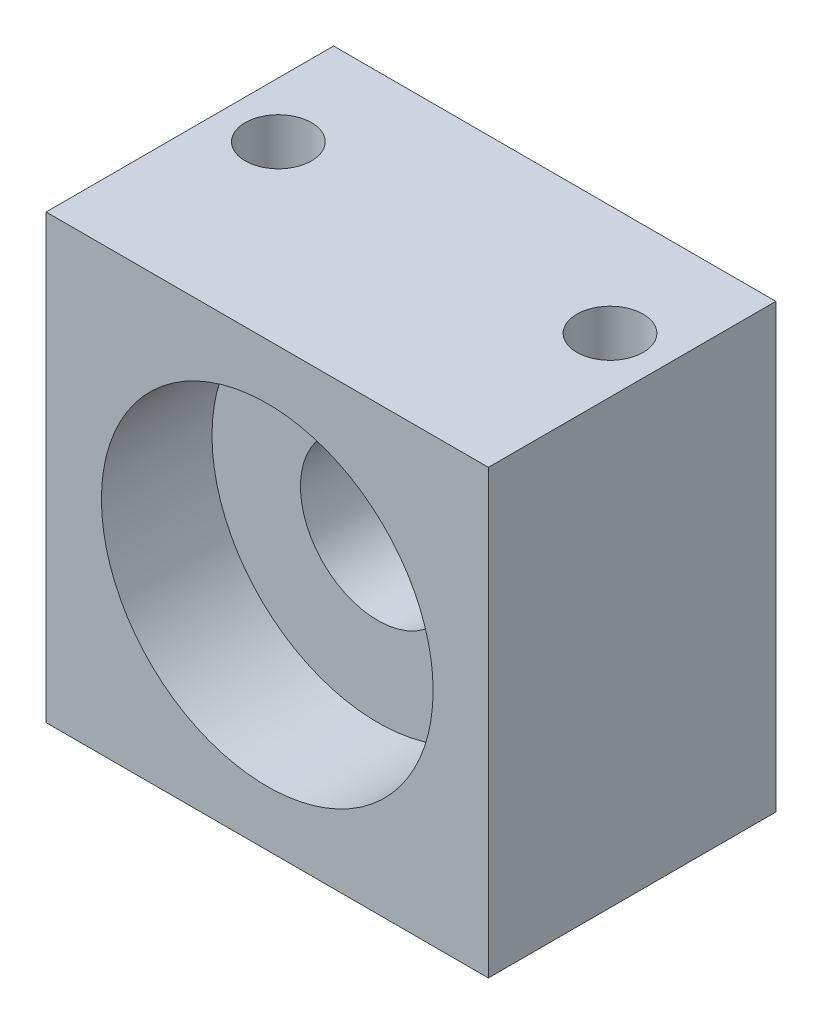
ISO-10303-21;
HEADER;
FILE_DESCRIPTION(('STEP AP214'),'2;1');
FILE_NAME('part.step','',(''),(''),'','','');
FILE_SCHEMA(('AUTOMOTIVE_DESIGN { 1 0 10303 214 1 1 1 1 }'));
ENDSEC;
DATA;
#1=APPLICATION_CONTEXT('core data for automotive mechanical design processes');
#2=APPLICATION_PROTOCOL_DEFINITION('international standard','automotive_design',2000,#1);
#3=PRODUCT_CONTEXT('',#1,'mechanical');
#4=PRODUCT('Part','Part','',(#3));
#5=PRODUCT_RELATED_PRODUCT_CATEGORY('part','',(#4));
#6=PRODUCT_DEFINITION_FORMATION('','',#4);
#7=PRODUCT_DEFINITION_CONTEXT('part definition',#1,'design');
#8=PRODUCT_DEFINITION('design','',#6,#7);
#9=PRODUCT_DEFINITION_SHAPE('','',#8);
#10=(LENGTH_UNIT() NAMED_UNIT(*) SI_UNIT(.MILLI.,.METRE.));
#11=(NAMED_UNIT(*) PLANE_ANGLE_UNIT() SI_UNIT($,.RADIAN.));
#12=(NAMED_UNIT(*) SI_UNIT($,.STERADIAN.) SOLID_ANGLE_UNIT());
#13=UNCERTAINTY_MEASURE_WITH_UNIT(LENGTH_MEASURE(1.E-05),#10,'distance_accuracy_value','');
#14=(GEOMETRIC_REPRESENTATION_CONTEXT(3) GLOBAL_UNCERTAINTY_ASSIGNED_CONTEXT((#13)) GLOBAL_UNIT_ASSIGNED_CONTEXT((#10,
#11,#12)) REPRESENTATION_CONTEXT('',''));
#15=CARTESIAN_POINT('',(0.,0.,0.));
#16=DIRECTION('',(0.,0.,1.));
#17=DIRECTION('',(1.,0.,0.));
#18=AXIS2_PLACEMENT_3D('',#15,#16,#17);
#19=CARTESIAN_POINT('',(0.,0.,13.));
#20=DIRECTION('',(1.,0.,0.));
#21=DIRECTION('',(0.,0.,-1.));
#22=AXIS2_PLACEMENT_3D('',#19,#20,#21);
#23=PLANE('',#22);
#24=DIRECTION('',(0.,-1.,0.));
#25=VECTOR('',#24,1.);
#26=CARTESIAN_POINT('',(0.,0.,0.));
#27=LINE('',#26,#25);
#28=CARTESIAN_POINT('',(0.,20.,0.));
#29=VERTEX_POINT('',#28);
#30=CARTESIAN_POINT('',(0.,0.,0.));
#31=VERTEX_POINT('',#30);
#32=EDGE_CURVE('E96',#29,#31,#27,.T.);
#33=ORIENTED_EDGE('',*,*,#32,.T.);
#34=DIRECTION('',(0.,0.,-1.));
#35=VECTOR('',#34,1.);
#36=CARTESIAN_POINT('',(0.,0.,13.));
#37=LINE('',#36,#35);
#38=CARTESIAN_POINT('',(0.,0.,13.));
#39=VERTEX_POINT('',#38);
#40=EDGE_CURVE('E11',#39,#31,#37,.T.);
#41=ORIENTED_EDGE('',*,*,#40,.F.);
#42=DIRECTION('',(0.,-1.,0.));
#43=VECTOR('',#42,1.);
#44=CARTESIAN_POINT('',(0.,0.,13.));
#45=LINE('',#44,#43);
#46=CARTESIAN_POINT('',(0.,20.,13.));
#47=VERTEX_POINT('',#46);
#48=EDGE_CURVE('E84',#47,#39,#45,.T.);
#49=ORIENTED_EDGE('',*,*,#48,.F.);
#50=DIRECTION('',(0.,0.,-1.));
#51=VECTOR('',#50,1.);
#52=CARTESIAN_POINT('',(0.,20.,13.));
#53=LINE('',#52,#51);
#54=EDGE_CURVE('E92',#47,#29,#53,.T.);
#55=ORIENTED_EDGE('',*,*,#54,.T.);
#56=EDGE_LOOP('',(#33,#41,#49,#55));
#57=FACE_BOUND('',#56,.T.);
#58=ADVANCED_FACE('F33',(#57),#23,.F.);
#59=CARTESIAN_POINT('',(0.,0.,13.));
#60=DIRECTION('',(0.,1.,0.));
#61=DIRECTION('',(0.,0.,1.));
#62=AXIS2_PLACEMENT_3D('',#59,#60,#61);
#63=PLANE('',#62);
#64=CARTESIAN_POINT('',(2.5,0.,5.));
#65=DIRECTION('',(0.,1.,0.));
#66=DIRECTION('',(0.,0.,1.));
#67=AXIS2_PLACEMENT_3D('',#64,#65,#66);
#68=CIRCLE('',#67,1.5);
#69=CARTESIAN_POINT('',(2.5,0.,6.5));
#70=VERTEX_POINT('',#69);
#71=EDGE_CURVE('E128',#70,#70,#68,.T.);
#72=ORIENTED_EDGE('',*,*,#71,.T.);
#73=EDGE_LOOP('',(#72));
#74=FACE_BOUND('',#73,.T.);
#75=CARTESIAN_POINT('',(17.5,0.,5.));
#76=DIRECTION('',(0.,1.,0.));
#77=DIRECTION('',(0.,0.,1.));
#78=AXIS2_PLACEMENT_3D('',#75,#76,#77);
#79=CIRCLE('',#78,1.5);
#80=CARTESIAN_POINT('',(17.5,0.,6.5));
#81=VERTEX_POINT('',#80);
#82=EDGE_CURVE('E119',#81,#81,#79,.T.);
#83=ORIENTED_EDGE('',*,*,#82,.T.);
#84=EDGE_LOOP('',(#83));
#85=FACE_BOUND('',#84,.T.);
#86=DIRECTION('',(1.,0.,0.));
#87=VECTOR('',#86,1.);
#88=CARTESIAN_POINT('',(0.,0.,0.));
#89=LINE('',#88,#87);
#90=CARTESIAN_POINT('',(20.,0.,0.));
#91=VERTEX_POINT('',#90);
#92=EDGE_CURVE('E88',#31,#91,#89,.T.);
#93=ORIENTED_EDGE('',*,*,#92,.T.);
#94=DIRECTION('',(0.,0.,-1.));
#95=VECTOR('',#94,1.);
#96=CARTESIAN_POINT('',(20.,0.,13.));
#97=LINE('',#96,#95);
#98=CARTESIAN_POINT('',(20.,0.,13.));
#99=VERTEX_POINT('',#98);
#100=EDGE_CURVE('E41',#99,#91,#97,.T.);
#101=ORIENTED_EDGE('',*,*,#100,.F.);
#102=DIRECTION('',(1.,0.,0.));
#103=VECTOR('',#102,1.);
#104=CARTESIAN_POINT('',(0.,0.,13.));
#105=LINE('',#104,#103);
#106=EDGE_CURVE('E79',#39,#99,#105,.T.);
#107=ORIENTED_EDGE('',*,*,#106,.F.);
#108=ORIENTED_EDGE('',*,*,#40,.T.);
#109=EDGE_LOOP('',(#93,#101,#107,#108));
#110=FACE_BOUND('',#109,.T.);
#111=ADVANCED_FACE('F87',(#74,#85,#110),#63,.F.);
#112=CARTESIAN_POINT('',(20.,0.,13.));
#113=DIRECTION('',(-1.,0.,0.));
#114=DIRECTION('',(0.,0.,1.));
#115=AXIS2_PLACEMENT_3D('',#112,#113,#114);
#116=PLANE('',#115);
#117=DIRECTION('',(0.,1.,0.));
#118=VECTOR('',#117,1.);
#119=CARTESIAN_POINT('',(20.,0.,0.));
#120=LINE('',#119,#118);
#121=CARTESIAN_POINT('',(20.,20.,0.));
#122=VERTEX_POINT('',#121);
#123=EDGE_CURVE('E66',#91,#122,#120,.T.);
#124=ORIENTED_EDGE('',*,*,#123,.T.);
#125=DIRECTION('',(0.,0.,-1.));
#126=VECTOR('',#125,1.);
#127=CARTESIAN_POINT('',(20.,20.,13.));
#128=LINE('',#127,#126);
#129=CARTESIAN_POINT('',(20.,20.,13.));
#130=VERTEX_POINT('',#129);
#131=EDGE_CURVE('E89',#130,#122,#128,.T.);
#132=ORIENTED_EDGE('',*,*,#131,.F.);
#133=DIRECTION('',(0.,1.,0.));
#134=VECTOR('',#133,1.);
#135=CARTESIAN_POINT('',(20.,0.,13.));
#136=LINE('',#135,#134);
#137=EDGE_CURVE('E82',#99,#130,#136,.T.);
#138=ORIENTED_EDGE('',*,*,#137,.F.);
#139=ORIENTED_EDGE('',*,*,#100,.T.);
#140=EDGE_LOOP('',(#124,#132,#138,#139));
#141=FACE_BOUND('',#140,.T.);
#142=ADVANCED_FACE('F90',(#141),#116,.F.);
#143=CARTESIAN_POINT('',(0.,20.,13.));
#144=DIRECTION('',(0.,-1.,0.));
#145=DIRECTION('',(0.,0.,-1.));
#146=AXIS2_PLACEMENT_3D('',#143,#144,#145);
#147=PLANE('',#146);
#148=CARTESIAN_POINT('',(2.5,20.,5.));
#149=DIRECTION('',(0.,1.,0.));
#150=DIRECTION('',(0.,0.,1.));
#151=AXIS2_PLACEMENT_3D('',#148,#149,#150);
#152=CIRCLE('',#151,1.5);
#153=CARTESIAN_POINT('',(2.5,20.,6.5));
#154=VERTEX_POINT('',#153);
#155=EDGE_CURVE('E125',#154,#154,#152,.T.);
#156=ORIENTED_EDGE('',*,*,#155,.F.);
#157=EDGE_LOOP('',(#156));
#158=FACE_BOUND('',#157,.T.);
#159=CARTESIAN_POINT('',(17.5,20.,5.));
#160=DIRECTION('',(0.,1.,0.));
#161=DIRECTION('',(0.,0.,1.));
#162=AXIS2_PLACEMENT_3D('',#159,#160,#161);
#163=CIRCLE('',#162,1.5);
#164=CARTESIAN_POINT('',(17.5,20.,6.5));
#165=VERTEX_POINT('',#164);
#166=EDGE_CURVE('E122',#165,#165,#163,.T.);
#167=ORIENTED_EDGE('',*,*,#166,.F.);
#168=EDGE_LOOP('',(#167));
#169=FACE_BOUND('',#168,.T.);
#170=DIRECTION('',(-1.,0.,0.));
#171=VECTOR('',#170,1.);
#172=CARTESIAN_POINT('',(0.,20.,0.));
#173=LINE('',#172,#171);
#174=EDGE_CURVE('E72',#122,#29,#173,.T.);
#175=ORIENTED_EDGE('',*,*,#174,.T.);
#176=ORIENTED_EDGE('',*,*,#54,.F.);
#177=DIRECTION('',(-1.,0.,0.));
#178=VECTOR('',#177,1.);
#179=CARTESIAN_POINT('',(0.,20.,13.));
#180=LINE('',#179,#178);
#181=EDGE_CURVE('E49',#130,#47,#180,.T.);
#182=ORIENTED_EDGE('',*,*,#181,.F.);
#183=ORIENTED_EDGE('',*,*,#131,.T.);
#184=EDGE_LOOP('',(#175,#176,#182,#183));
#185=FACE_BOUND('',#184,.T.);
#186=ADVANCED_FACE('F104',(#158,#169,#185),#147,.F.);
#187=CARTESIAN_POINT('',(0.,0.,13.));
#188=DIRECTION('',(0.,0.,-1.));
#189=DIRECTION('',(-1.,0.,0.));
#190=AXIS2_PLACEMENT_3D('',#187,#188,#189);
#191=PLANE('',#190);
#192=CARTESIAN_POINT('',(10.,10.,13.));
#193=DIRECTION('',(0.,0.,1.));
#194=DIRECTION('',(1.,0.,0.));
#195=AXIS2_PLACEMENT_3D('',#192,#193,#194);
#196=CIRCLE('',#195,7.5);
#197=CARTESIAN_POINT('',(17.5,10.,13.));
#198=VERTEX_POINT('',#197);
#199=EDGE_CURVE('E110',#198,#198,#196,.T.);
#200=ORIENTED_EDGE('',*,*,#199,.F.);
#201=EDGE_LOOP('',(#200));
#202=FACE_BOUND('',#201,.T.);
#203=ORIENTED_EDGE('',*,*,#48,.T.);
#204=ORIENTED_EDGE('',*,*,#106,.T.);
#205=ORIENTED_EDGE('',*,*,#137,.T.);
#206=ORIENTED_EDGE('',*,*,#181,.T.);
#207=EDGE_LOOP('',(#203,#204,#205,#206));
#208=FACE_BOUND('',#207,.T.);
#209=ADVANCED_FACE('F80',(#202,#208),#191,.F.);
#210=CARTESIAN_POINT('',(0.,0.,0.));
#211=DIRECTION('',(0.,0.,-1.));
#212=DIRECTION('',(-1.,0.,0.));
#213=AXIS2_PLACEMENT_3D('',#210,#211,#212);
#214=PLANE('',#213);
#215=ORIENTED_EDGE('',*,*,#32,.F.);
#216=ORIENTED_EDGE('',*,*,#174,.F.);
#217=ORIENTED_EDGE('',*,*,#123,.F.);
#218=ORIENTED_EDGE('',*,*,#92,.F.);
#219=EDGE_LOOP('',(#215,#216,#217,#218));
#220=FACE_BOUND('',#219,.T.);
#221=ADVANCED_FACE('F107',(#220),#214,.T.);
#222=CARTESIAN_POINT('',(10.,10.,8.));
#223=DIRECTION('',(0.,0.,1.));
#224=DIRECTION('',(1.,0.,0.));
#225=AXIS2_PLACEMENT_3D('',#222,#223,#224);
#226=CYLINDRICAL_SURFACE('',#225,7.5);
#227=CARTESIAN_POINT('',(10.,10.,8.));
#228=DIRECTION('',(0.,0.,1.));
#229=DIRECTION('',(1.,0.,0.));
#230=AXIS2_PLACEMENT_3D('',#227,#228,#229);
#231=CIRCLE('',#230,7.5);
#232=CARTESIAN_POINT('',(17.5,10.,8.));
#233=VERTEX_POINT('',#232);
#234=EDGE_CURVE('E99',#233,#233,#231,.T.);
#235=ORIENTED_EDGE('',*,*,#234,.F.);
#236=EDGE_LOOP('',(#235));
#237=FACE_BOUND('',#236,.T.);
#238=ORIENTED_EDGE('',*,*,#199,.T.);
#239=EDGE_LOOP('',(#238));
#240=FACE_BOUND('',#239,.T.);
#241=ADVANCED_FACE('F169',(#237,#240),#226,.F.);
#242=CARTESIAN_POINT('',(10.,10.,8.));
#243=DIRECTION('',(0.,0.,1.));
#244=DIRECTION('',(1.,0.,0.));
#245=AXIS2_PLACEMENT_3D('',#242,#243,#244);
#246=PLANE('',#245);
#247=CARTESIAN_POINT('',(10.,10.,8.));
#248=DIRECTION('',(0.,0.,1.));
#249=DIRECTION('',(1.,0.,0.));
#250=AXIS2_PLACEMENT_3D('',#247,#248,#249);
#251=CIRCLE('',#250,3.5);
#252=CARTESIAN_POINT('',(13.5,10.,8.));
#253=VERTEX_POINT('',#252);
#254=EDGE_CURVE('E116',#253,#253,#251,.T.);
#255=ORIENTED_EDGE('',*,*,#254,.F.);
#256=EDGE_LOOP('',(#255));
#257=FACE_BOUND('',#256,.T.);
#258=ORIENTED_EDGE('',*,*,#234,.T.);
#259=EDGE_LOOP('',(#258));
#260=FACE_BOUND('',#259,.T.);
#261=ADVANCED_FACE('F175',(#257,#260),#246,.T.);
#262=CARTESIAN_POINT('',(10.,10.,3.));
#263=DIRECTION('',(0.,0.,1.));
#264=DIRECTION('',(1.,0.,0.));
#265=AXIS2_PLACEMENT_3D('',#262,#263,#264);
#266=CYLINDRICAL_SURFACE('',#265,3.5);
#267=CARTESIAN_POINT('',(10.,10.,3.));
#268=DIRECTION('',(0.,0.,1.));
#269=DIRECTION('',(1.,0.,0.));
#270=AXIS2_PLACEMENT_3D('',#267,#268,#269);
#271=CIRCLE('',#270,3.5);
#272=CARTESIAN_POINT('',(13.5,10.,3.));
#273=VERTEX_POINT('',#272);
#274=EDGE_CURVE('E113',#273,#273,#271,.T.);
#275=ORIENTED_EDGE('',*,*,#274,.F.);
#276=EDGE_LOOP('',(#275));
#277=FACE_BOUND('',#276,.T.);
#278=ORIENTED_EDGE('',*,*,#254,.T.);
#279=EDGE_LOOP('',(#278));
#280=FACE_BOUND('',#279,.T.);
#281=ADVANCED_FACE('F152',(#277,#280),#266,.F.);
#282=CARTESIAN_POINT('',(10.,10.,3.));
#283=DIRECTION('',(0.,0.,1.));
#284=DIRECTION('',(1.,0.,0.));
#285=AXIS2_PLACEMENT_3D('',#282,#283,#284);
#286=PLANE('',#285);
#287=ORIENTED_EDGE('',*,*,#274,.T.);
#288=EDGE_LOOP('',(#287));
#289=FACE_BOUND('',#288,.T.);
#290=ADVANCED_FACE('F143',(#289),#286,.T.);
#291=CARTESIAN_POINT('',(17.5,0.,5.));
#292=DIRECTION('',(0.,1.,0.));
#293=DIRECTION('',(0.,0.,1.));
#294=AXIS2_PLACEMENT_3D('',#291,#292,#293);
#295=CYLINDRICAL_SURFACE('',#294,1.5);
#296=ORIENTED_EDGE('',*,*,#82,.F.);
#297=EDGE_LOOP('',(#296));
#298=FACE_BOUND('',#297,.T.);
#299=ORIENTED_EDGE('',*,*,#166,.T.);
#300=EDGE_LOOP('',(#299));
#301=FACE_BOUND('',#300,.T.);
#302=ADVANCED_FACE('F141',(#298,#301),#295,.F.);
#303=CARTESIAN_POINT('',(2.5,0.,5.));
#304=DIRECTION('',(0.,1.,0.));
#305=DIRECTION('',(0.,0.,1.));
#306=AXIS2_PLACEMENT_3D('',#303,#304,#305);
#307=CYLINDRICAL_SURFACE('',#306,1.5);
#308=ORIENTED_EDGE('',*,*,#71,.F.);
#309=EDGE_LOOP('',(#308));
#310=FACE_BOUND('',#309,.T.);
#311=ORIENTED_EDGE('',*,*,#155,.T.);
#312=EDGE_LOOP('',(#311));
#313=FACE_BOUND('',#312,.T.);
#314=ADVANCED_FACE('F134',(#310,#313),#307,.F.);
#315=CLOSED_SHELL('',(#58,#111,#142,#186,#209,#221,#241,#261,#281,#290,#302,#314));
#316=MANIFOLD_SOLID_BREP('B2',#315);
#317=ADVANCED_BREP_SHAPE_REPRESENTATION('',(#18,#316),#14);
#318=SHAPE_DEFINITION_REPRESENTATION(#9,#317);
ENDSEC;
END-ISO-10303-21;
